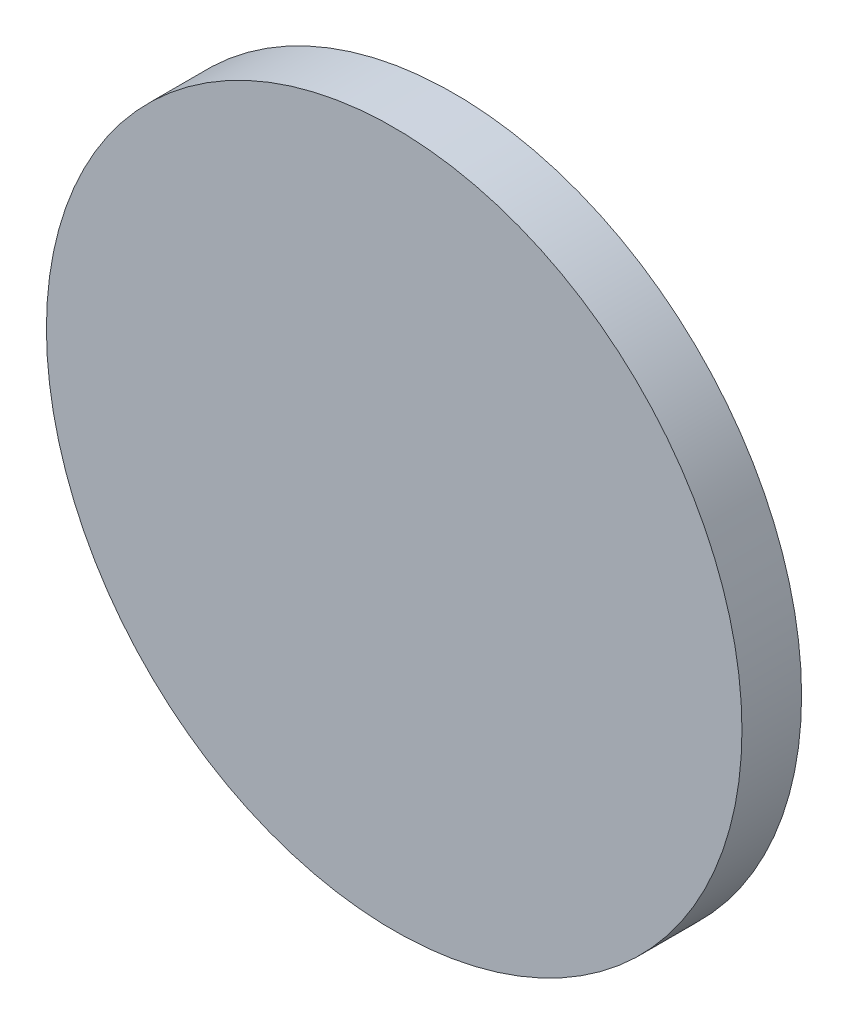
ISO-10303-21;
HEADER;
FILE_DESCRIPTION(('STEP AP214'),'2;1');
FILE_NAME('part.step','',(''),(''),'','','');
FILE_SCHEMA(('AUTOMOTIVE_DESIGN { 1 0 10303 214 1 1 1 1 }'));
ENDSEC;
DATA;
#1=APPLICATION_CONTEXT('core data for automotive mechanical design processes');
#2=APPLICATION_PROTOCOL_DEFINITION('international standard','automotive_design',2000,#1);
#3=PRODUCT_CONTEXT('',#1,'mechanical');
#4=PRODUCT('Part','Part','',(#3));
#5=PRODUCT_RELATED_PRODUCT_CATEGORY('part','',(#4));
#6=PRODUCT_DEFINITION_FORMATION('','',#4);
#7=PRODUCT_DEFINITION_CONTEXT('part definition',#1,'design');
#8=PRODUCT_DEFINITION('design','',#6,#7);
#9=PRODUCT_DEFINITION_SHAPE('','',#8);
#10=(LENGTH_UNIT() NAMED_UNIT(*) SI_UNIT(.MILLI.,.METRE.));
#11=(NAMED_UNIT(*) PLANE_ANGLE_UNIT() SI_UNIT($,.RADIAN.));
#12=(NAMED_UNIT(*) SI_UNIT($,.STERADIAN.) SOLID_ANGLE_UNIT());
#13=UNCERTAINTY_MEASURE_WITH_UNIT(LENGTH_MEASURE(1.E-05),#10,'distance_accuracy_value','');
#14=(GEOMETRIC_REPRESENTATION_CONTEXT(3) GLOBAL_UNCERTAINTY_ASSIGNED_CONTEXT((#13)) GLOBAL_UNIT_ASSIGNED_CONTEXT((#10,
#11,#12)) REPRESENTATION_CONTEXT('',''));
#15=CARTESIAN_POINT('',(0.,0.,0.));
#16=DIRECTION('',(0.,0.,1.));
#17=DIRECTION('',(1.,0.,0.));
#18=AXIS2_PLACEMENT_3D('',#15,#16,#17);
#19=CARTESIAN_POINT('',(9.40008,10.900000014875,0.76487));
#20=DIRECTION('',(0.,0.,-1.));
#21=DIRECTION('',(-1.,0.,0.));
#22=AXIS2_PLACEMENT_3D('',#19,#20,#21);
#23=PLANE('',#22);
#24=CARTESIAN_POINT('',(9.40008,10.900000014875,0.76487));
#25=DIRECTION('',(0.,0.,1.));
#26=DIRECTION('',(1.,0.,0.));
#27=AXIS2_PLACEMENT_3D('',#24,#25,#26);
#28=CIRCLE('',#27,0.200024667);
#29=CARTESIAN_POINT('',(9.600104667,10.900000014875,0.76487));
#30=VERTEX_POINT('',#29);
#31=EDGE_CURVE('E18',#30,#30,#28,.T.);
#32=ORIENTED_EDGE('',*,*,#31,.F.);
#33=EDGE_LOOP('',(#32));
#34=FACE_BOUND('',#33,.T.);
#35=ADVANCED_FACE('F15',(#34),#23,.T.);
#36=CARTESIAN_POINT('',(9.40008,10.900000014875,0.76487));
#37=DIRECTION('',(0.,0.,1.));
#38=DIRECTION('',(1.,0.,0.));
#39=AXIS2_PLACEMENT_3D('',#36,#37,#38);
#40=CYLINDRICAL_SURFACE('',#39,0.200024667);
#41=CARTESIAN_POINT('',(9.40008,10.900000014875,0.79916));
#42=DIRECTION('',(0.,0.,1.));
#43=DIRECTION('',(1.,0.,0.));
#44=AXIS2_PLACEMENT_3D('',#41,#42,#43);
#45=CIRCLE('',#44,0.200024667);
#46=CARTESIAN_POINT('',(9.600104667,10.900000014875,0.79916));
#47=VERTEX_POINT('',#46);
#48=EDGE_CURVE('E10',#47,#47,#45,.T.);
#49=ORIENTED_EDGE('',*,*,#48,.F.);
#50=EDGE_LOOP('',(#49));
#51=FACE_BOUND('',#50,.T.);
#52=ORIENTED_EDGE('',*,*,#31,.T.);
#53=EDGE_LOOP('',(#52));
#54=FACE_BOUND('',#53,.T.);
#55=ADVANCED_FACE('F27',(#51,#54),#40,.T.);
#56=CARTESIAN_POINT('',(9.40008,10.900000014875,0.79916));
#57=DIRECTION('',(0.,0.,1.));
#58=DIRECTION('',(1.,0.,0.));
#59=AXIS2_PLACEMENT_3D('',#56,#57,#58);
#60=PLANE('',#59);
#61=ORIENTED_EDGE('',*,*,#48,.T.);
#62=EDGE_LOOP('',(#61));
#63=FACE_BOUND('',#62,.T.);
#64=ADVANCED_FACE('F34',(#63),#60,.T.);
#65=CLOSED_SHELL('',(#35,#55,#64));
#66=MANIFOLD_SOLID_BREP('B1',#65);
#67=ADVANCED_BREP_SHAPE_REPRESENTATION('',(#18,#66),#14);
#68=SHAPE_DEFINITION_REPRESENTATION(#9,#67);
ENDSEC;
END-ISO-10303-21;
